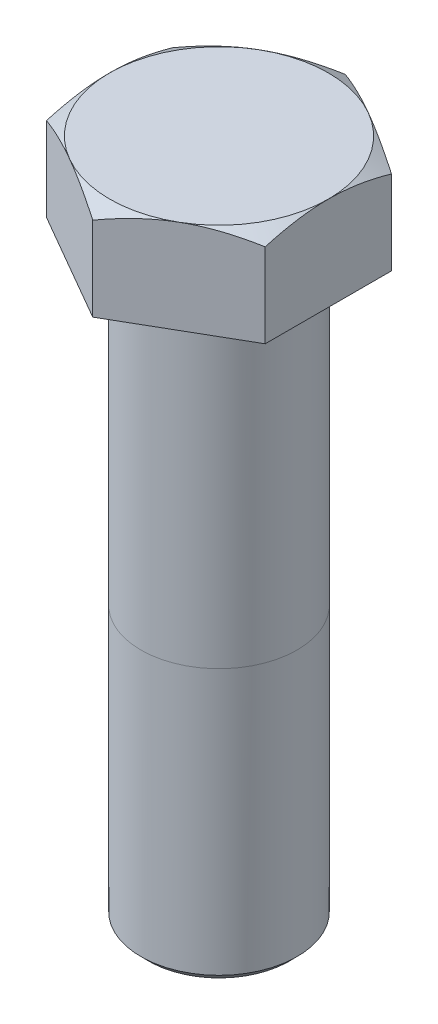
ISO-10303-21;
HEADER;
FILE_DESCRIPTION(('STEP AP214'),'2;1');
FILE_NAME('part.step','',(''),(''),'','','');
FILE_SCHEMA(('AUTOMOTIVE_DESIGN { 1 0 10303 214 1 1 1 1 }'));
ENDSEC;
DATA;
#1=APPLICATION_CONTEXT('core data for automotive mechanical design processes');
#2=APPLICATION_PROTOCOL_DEFINITION('international standard','automotive_design',2000,#1);
#3=PRODUCT_CONTEXT('',#1,'mechanical');
#4=PRODUCT('Part','Part','',(#3));
#5=PRODUCT_RELATED_PRODUCT_CATEGORY('part','',(#4));
#6=PRODUCT_DEFINITION_FORMATION('','',#4);
#7=PRODUCT_DEFINITION_CONTEXT('part definition',#1,'design');
#8=PRODUCT_DEFINITION('design','',#6,#7);
#9=PRODUCT_DEFINITION_SHAPE('','',#8);
#10=(LENGTH_UNIT() NAMED_UNIT(*) SI_UNIT(.MILLI.,.METRE.));
#11=(NAMED_UNIT(*) PLANE_ANGLE_UNIT() SI_UNIT($,.RADIAN.));
#12=(NAMED_UNIT(*) SI_UNIT($,.STERADIAN.) SOLID_ANGLE_UNIT());
#13=UNCERTAINTY_MEASURE_WITH_UNIT(LENGTH_MEASURE(1.E-05),#10,'distance_accuracy_value','');
#14=(GEOMETRIC_REPRESENTATION_CONTEXT(3) GLOBAL_UNCERTAINTY_ASSIGNED_CONTEXT((#13)) GLOBAL_UNIT_ASSIGNED_CONTEXT((#10,
#11,#12)) REPRESENTATION_CONTEXT('',''));
#15=CARTESIAN_POINT('',(0.,0.,0.));
#16=DIRECTION('',(0.,0.,1.));
#17=DIRECTION('',(1.,0.,0.));
#18=AXIS2_PLACEMENT_3D('',#15,#16,#17);
#19=CARTESIAN_POINT('',(0.,-75.,0.));
#20=DIRECTION('',(0.,1.,0.));
#21=DIRECTION('',(0.,0.,1.));
#22=AXIS2_PLACEMENT_3D('',#19,#20,#21);
#23=CYLINDRICAL_SURFACE('',#22,10.);
#24=CARTESIAN_POINT('',(0.,-74.,0.));
#25=DIRECTION('',(0.,-1.,0.));
#26=DIRECTION('',(0.,0.,-1.));
#27=AXIS2_PLACEMENT_3D('',#24,#25,#26);
#28=CIRCLE('',#27,10.);
#29=CARTESIAN_POINT('',(0.,-74.,-10.));
#30=VERTEX_POINT('',#29);
#31=EDGE_CURVE('E233',#30,#30,#28,.F.);
#32=ORIENTED_EDGE('',*,*,#31,.T.);
#33=EDGE_LOOP('',(#32));
#34=FACE_BOUND('',#33,.T.);
#35=CARTESIAN_POINT('',(0.,-40.,0.));
#36=DIRECTION('',(0.,1.,0.));
#37=DIRECTION('',(-1.,0.,0.));
#38=AXIS2_PLACEMENT_3D('',#35,#36,#37);
#39=CIRCLE('',#38,10.);
#40=CARTESIAN_POINT('',(-10.,-40.,0.));
#41=VERTEX_POINT('',#40);
#42=CARTESIAN_POINT('',(10.,-40.,0.));
#43=VERTEX_POINT('',#42);
#44=EDGE_CURVE('E12',#41,#43,#39,.T.);
#45=ORIENTED_EDGE('',*,*,#44,.F.);
#46=EDGE_CURVE('E42',#43,#41,#39,.T.);
#47=ORIENTED_EDGE('',*,*,#46,.F.);
#48=EDGE_LOOP('',(#45,#47));
#49=FACE_BOUND('',#48,.T.);
#50=ADVANCED_FACE('F38',(#34,#49),#23,.T.);
#51=CARTESIAN_POINT('',(0.,0.,0.));
#52=DIRECTION('',(0.,1.,0.));
#53=DIRECTION('',(0.,0.,1.));
#54=AXIS2_PLACEMENT_3D('',#51,#52,#53);
#55=PLANE('',#54);
#56=DIRECTION('',(-0.866025403784438,0.,-0.5));
#57=VECTOR('',#56,1.);
#58=CARTESIAN_POINT('',(14.,0.,-8.08290376865478));
#59=LINE('',#58,#57);
#60=CARTESIAN_POINT('',(14.,0.,-8.08290376865478));
#61=VERTEX_POINT('',#60);
#62=CARTESIAN_POINT('',(0.,0.,-16.1658075373095));
#63=VERTEX_POINT('',#62);
#64=EDGE_CURVE('E122',#61,#63,#59,.T.);
#65=ORIENTED_EDGE('',*,*,#64,.F.);
#66=DIRECTION('',(0.,0.,-1.));
#67=VECTOR('',#66,1.);
#68=CARTESIAN_POINT('',(14.,0.,8.08290376865478));
#69=LINE('',#68,#67);
#70=CARTESIAN_POINT('',(14.,0.,8.08290376865478));
#71=VERTEX_POINT('',#70);
#72=EDGE_CURVE('E396',#71,#61,#69,.T.);
#73=ORIENTED_EDGE('',*,*,#72,.F.);
#74=DIRECTION('',(0.866025403784439,0.,-0.5));
#75=VECTOR('',#74,1.);
#76=CARTESIAN_POINT('',(0.,0.,16.1658075373095));
#77=LINE('',#76,#75);
#78=CARTESIAN_POINT('',(0.,0.,16.1658075373095));
#79=VERTEX_POINT('',#78);
#80=EDGE_CURVE('E391',#79,#71,#77,.T.);
#81=ORIENTED_EDGE('',*,*,#80,.F.);
#82=DIRECTION('',(0.866025403784439,0.,0.5));
#83=VECTOR('',#82,1.);
#84=CARTESIAN_POINT('',(-14.,0.,8.08290376865477));
#85=LINE('',#84,#83);
#86=CARTESIAN_POINT('',(-14.,0.,8.08290376865477));
#87=VERTEX_POINT('',#86);
#88=EDGE_CURVE('E389',#87,#79,#85,.T.);
#89=ORIENTED_EDGE('',*,*,#88,.F.);
#90=DIRECTION('',(0.,0.,1.));
#91=VECTOR('',#90,1.);
#92=CARTESIAN_POINT('',(-14.,0.,-8.08290376865478));
#93=LINE('',#92,#91);
#94=CARTESIAN_POINT('',(-14.,0.,-8.08290376865478));
#95=VERTEX_POINT('',#94);
#96=EDGE_CURVE('E371',#95,#87,#93,.T.);
#97=ORIENTED_EDGE('',*,*,#96,.F.);
#98=DIRECTION('',(-0.866025403784439,0.,0.5));
#99=VECTOR('',#98,1.);
#100=CARTESIAN_POINT('',(0.,0.,-16.1658075373095));
#101=LINE('',#100,#99);
#102=EDGE_CURVE('E386',#63,#95,#101,.T.);
#103=ORIENTED_EDGE('',*,*,#102,.F.);
#104=EDGE_LOOP('',(#65,#73,#81,#89,#97,#103));
#105=FACE_BOUND('',#104,.T.);
#106=CARTESIAN_POINT('',(0.,0.,0.));
#107=DIRECTION('',(0.,1.,0.));
#108=DIRECTION('',(0.,0.,1.));
#109=AXIS2_PLACEMENT_3D('',#106,#107,#108);
#110=CIRCLE('',#109,10.);
#111=CARTESIAN_POINT('',(0.,0.,10.));
#112=VERTEX_POINT('',#111);
#113=EDGE_CURVE('E140',#112,#112,#110,.F.);
#114=ORIENTED_EDGE('',*,*,#113,.F.);
#115=EDGE_LOOP('',(#114));
#116=FACE_BOUND('',#115,.T.);
#117=ADVANCED_FACE('F211',(#105,#116),#55,.F.);
#118=CARTESIAN_POINT('',(14.,12.,-8.08290376865478));
#119=DIRECTION('',(-0.5,0.,0.866025403784439));
#120=DIRECTION('',(0.866025403784439,0.,0.5));
#121=AXIS2_PLACEMENT_3D('',#118,#119,#120);
#122=PLANE('',#121);
#123=CARTESIAN_POINT('',(14.0002,10.7495037679405,-8.08278829860094));
#124=CARTESIAN_POINT('',(13.6924853904181,10.8520687355185,-8.26044741127664));
#125=CARTESIAN_POINT('',(13.3835705284393,10.9499795109551,-8.43879948999678));
#126=CARTESIAN_POINT('',(12.7632636692859,11.1351989694353,-8.79693382210913));
#127=CARTESIAN_POINT('',(12.4518708930622,11.2225041654761,-8.97671652528559));
#128=CARTESIAN_POINT('',(11.8260063991707,11.3853389062415,-9.33805955931009));
#129=CARTESIAN_POINT('',(11.5115292047329,11.4608405894043,-9.51962305217278));
#130=CARTESIAN_POINT('',(10.8803895759989,11.5984470625897,-9.88401168671856));
#131=CARTESIAN_POINT('',(10.5637272674325,11.6605526168897,-10.0668367558116));
#132=CARTESIAN_POINT('',(9.93633151674918,11.7687252680104,-10.429063861357));
#133=CARTESIAN_POINT('',(9.62564465325542,11.8151503964399,-10.6084390056288));
#134=CARTESIAN_POINT('',(9.00284729327513,11.8929951265451,-10.968011229064));
#135=CARTESIAN_POINT('',(8.69073676950317,11.9244144393938,-11.1482083239807));
#136=CARTESIAN_POINT('',(8.06599141476663,11.9714542186344,-11.5089052227128));
#137=CARTESIAN_POINT('',(7.75335765114503,11.9870934589966,-11.6894044102975));
#138=CARTESIAN_POINT('',(7.12780152662096,12.0022367596143,-12.0505694071847));
#139=CARTESIAN_POINT('',(6.81487917493453,12.0017413184259,-12.2312352111663));
#140=CARTESIAN_POINT('',(6.22987230119103,11.9857422399056,-12.5689890871999));
#141=CARTESIAN_POINT('',(5.95774609067864,11.9721901053227,-12.7261012280928));
#142=CARTESIAN_POINT('',(5.41411962233189,11.9331392398875,-13.0399641159314));
#143=CARTESIAN_POINT('',(5.14261941013851,11.9076396640127,-13.1967148365263));
#144=CARTESIAN_POINT('',(4.60039240839667,11.8451385190432,-13.5097697419438));
#145=CARTESIAN_POINT('',(4.32966644468921,11.8081274502385,-13.6660734499669));
#146=CARTESIAN_POINT('',(3.78948373337593,11.7232526731859,-13.9779480837552));
#147=CARTESIAN_POINT('',(3.52002707332628,11.6753882271492,-14.1335189589698));
#148=CARTESIAN_POINT('',(2.70207638818785,11.514304872236,-14.6057630072184));
#149=CARTESIAN_POINT('',(2.15595101855753,11.3850242516312,-14.9210686363857));
#150=CARTESIAN_POINT('',(1.07184369066131,11.0916100987946,-15.546978293977));
#151=CARTESIAN_POINT('',(0.533847852112659,10.9275454762133,-15.857590336186));
#152=CARTESIAN_POINT('',(-0.000199999999997578,10.7495037679405,-16.1659230073634));
#153=B_SPLINE_CURVE_WITH_KNOTS('',3,(#123,#124,#125,#126,#127,#128,#129,#130,#131,#132,#133,
#134,#135,#136,#137,#138,#139,#140,#141,#142,#143,#144,#145,#146,#147,#148,#149,#150,#151,#152),
.UNSPECIFIED.,.F.,.F.,(4,2,2,2,2,2,2,2,2,2,2,2,2,2,4),(0.,1.10950436744395,2.21937254652007,
3.33182219257025,4.44420835421649,5.52913815688045,6.6140888410734,7.69774720328185,
8.78137208085321,9.72469383358151,10.6680823159394,11.6122513923123,12.5564846704803,
14.4864746839191,16.412676387916),.UNSPECIFIED.);
#154=CARTESIAN_POINT('',(14.,10.7495704353214,-8.08290376865478));
#155=VERTEX_POINT('',#154);
#156=CARTESIAN_POINT('',(7.00000000000001,12.,-12.1243556529822));
#157=VERTEX_POINT('',#156);
#158=EDGE_CURVE('E111',#155,#157,#153,.T.);
#159=ORIENTED_EDGE('',*,*,#158,.F.);
#160=DIRECTION('',(0.,-1.,0.));
#161=VECTOR('',#160,1.);
#162=CARTESIAN_POINT('',(14.,12.,-8.08290376865478));
#163=LINE('',#162,#161);
#164=EDGE_CURVE('E399',#155,#61,#163,.T.);
#165=ORIENTED_EDGE('',*,*,#164,.T.);
#166=ORIENTED_EDGE('',*,*,#64,.T.);
#167=DIRECTION('',(0.,-1.,0.));
#168=VECTOR('',#167,1.);
#169=CARTESIAN_POINT('',(0.,12.,-16.1658075373095));
#170=LINE('',#169,#168);
#171=CARTESIAN_POINT('',(0.,10.7495704353214,-16.1658075373095));
#172=VERTEX_POINT('',#171);
#173=EDGE_CURVE('E145',#172,#63,#170,.T.);
#174=ORIENTED_EDGE('',*,*,#173,.F.);
#175=EDGE_CURVE('E123',#157,#172,#153,.T.);
#176=ORIENTED_EDGE('',*,*,#175,.F.);
#177=EDGE_LOOP('',(#159,#165,#166,#174,#176));
#178=FACE_BOUND('',#177,.T.);
#179=ADVANCED_FACE('F143',(#178),#122,.F.);
#180=CARTESIAN_POINT('',(0.,12.,-16.1658075373095));
#181=DIRECTION('',(0.5,0.,0.866025403784439));
#182=DIRECTION('',(0.866025403784439,0.,-0.5));
#183=AXIS2_PLACEMENT_3D('',#180,#181,#182);
#184=PLANE('',#183);
#185=CARTESIAN_POINT('',(0.000200000000001851,10.7495037679405,-16.1659230073634));
#186=CARTESIAN_POINT('',(-0.307514609581919,10.8520687355185,-15.9882638946877));
#187=CARTESIAN_POINT('',(-0.616429471560717,10.9499795109551,-15.8099118159675));
#188=CARTESIAN_POINT('',(-1.23673633071406,11.1351989694353,-15.4517774838552));
#189=CARTESIAN_POINT('',(-1.54812910693776,11.2225041654761,-15.2719947806787));
#190=CARTESIAN_POINT('',(-2.17399360082929,11.3853389062415,-14.9106517466542));
#191=CARTESIAN_POINT('',(-2.48847079526713,11.4608405894043,-14.7290882537915));
#192=CARTESIAN_POINT('',(-3.11961042400107,11.5984470625897,-14.3646996192458));
#193=CARTESIAN_POINT('',(-3.43627273256746,11.6605526168897,-14.1818745501527));
#194=CARTESIAN_POINT('',(-4.06366848325082,11.7687252680104,-13.8196474446073));
#195=CARTESIAN_POINT('',(-4.37435534674458,11.8151503964399,-13.6402723003355));
#196=CARTESIAN_POINT('',(-4.99715270672487,11.8929951265451,-13.2807000769003));
#197=CARTESIAN_POINT('',(-5.30926323049683,11.9244144393938,-13.1005029819836));
#198=CARTESIAN_POINT('',(-5.93400858523337,11.9714542186344,-12.7398060832515));
#199=CARTESIAN_POINT('',(-6.24664234885497,11.9870934589966,-12.5593068956668));
#200=CARTESIAN_POINT('',(-6.87219847337904,12.0022367596143,-12.1981418987796));
#201=CARTESIAN_POINT('',(-7.18512082506547,12.0017413184259,-12.017476094798));
#202=CARTESIAN_POINT('',(-7.77012769880897,11.9857422399056,-11.6797222187644));
#203=CARTESIAN_POINT('',(-8.04225390932136,11.9721901053227,-11.5226100778715));
#204=CARTESIAN_POINT('',(-8.58588037766811,11.9331392398875,-11.2087471900329));
#205=CARTESIAN_POINT('',(-8.85738058986149,11.9076396640127,-11.051996469438));
#206=CARTESIAN_POINT('',(-9.39960759160333,11.8451385190432,-10.7389415640205));
#207=CARTESIAN_POINT('',(-9.67033355531079,11.8081274502385,-10.5826378559974));
#208=CARTESIAN_POINT('',(-10.2105162666241,11.7232526731859,-10.2707632222091));
#209=CARTESIAN_POINT('',(-10.4799729266737,11.6753882271492,-10.1151923469945));
#210=CARTESIAN_POINT('',(-11.2979236118122,11.514304872236,-9.64294829874596));
#211=CARTESIAN_POINT('',(-11.8440489814425,11.3850242516312,-9.32764266957861));
#212=CARTESIAN_POINT('',(-12.9281563093387,11.0916100987946,-8.70173301198729));
#213=CARTESIAN_POINT('',(-13.4661521478873,10.9275454762133,-8.39112096977833));
#214=CARTESIAN_POINT('',(-14.0002,10.7495037679405,-8.08278829860094));
#215=B_SPLINE_CURVE_WITH_KNOTS('',3,(#185,#186,#187,#188,#189,#190,#191,#192,#193,#194,#195,
#196,#197,#198,#199,#200,#201,#202,#203,#204,#205,#206,#207,#208,#209,#210,#211,#212,#213,#214),
.UNSPECIFIED.,.F.,.F.,(4,2,2,2,2,2,2,2,2,2,2,2,2,2,4),(0.,1.10950436744395,2.21937254652007,
3.33182219257025,4.44420835421649,5.52913815688045,6.6140888410734,7.69774720328186,
8.78137208085321,9.72469383358152,10.6680823159394,11.6122513923124,12.5564846704803,
14.4864746839191,16.412676387916),.UNSPECIFIED.);
#216=CARTESIAN_POINT('',(-7.,12.,-12.1243556529822));
#217=VERTEX_POINT('',#216);
#218=EDGE_CURVE('E130',#172,#217,#215,.T.);
#219=ORIENTED_EDGE('',*,*,#218,.F.);
#220=ORIENTED_EDGE('',*,*,#173,.T.);
#221=ORIENTED_EDGE('',*,*,#102,.T.);
#222=DIRECTION('',(0.,-1.,0.));
#223=VECTOR('',#222,1.);
#224=CARTESIAN_POINT('',(-14.,12.,-8.08290376865478));
#225=LINE('',#224,#223);
#226=CARTESIAN_POINT('',(-14.,10.7495704353214,-8.08290376865478));
#227=VERTEX_POINT('',#226);
#228=EDGE_CURVE('E373',#227,#95,#225,.T.);
#229=ORIENTED_EDGE('',*,*,#228,.F.);
#230=EDGE_CURVE('E146',#217,#227,#215,.T.);
#231=ORIENTED_EDGE('',*,*,#230,.F.);
#232=EDGE_LOOP('',(#219,#220,#221,#229,#231));
#233=FACE_BOUND('',#232,.T.);
#234=ADVANCED_FACE('F202',(#233),#184,.F.);
#235=CARTESIAN_POINT('',(-14.,12.,-8.08290376865478));
#236=DIRECTION('',(1.,0.,0.));
#237=DIRECTION('',(0.,0.,-1.));
#238=AXIS2_PLACEMENT_3D('',#235,#236,#237);
#239=PLANE('',#238);
#240=CARTESIAN_POINT('',(-14.,4.99292627411982,-22.0708464349856));
#241=CARTESIAN_POINT('',(-14.,5.14275125073713,-21.763531713594));
#242=CARTESIAN_POINT('',(-14.,5.29185573746869,-21.4558658946682));
#243=CARTESIAN_POINT('',(-14.,5.58846120919052,-20.8397589075048));
#244=CARTESIAN_POINT('',(-14.,5.73596217910167,-20.5313177320094));
#245=CARTESIAN_POINT('',(-14.,6.17585267186016,-19.604644051866));
#246=CARTESIAN_POINT('',(-14.,6.46558794103416,-18.9851469805474));
#247=CARTESIAN_POINT('',(-14.,7.03777843217461,-17.7389229296623));
#248=CARTESIAN_POINT('',(-14.,7.32018844259813,-17.1121751438084));
#249=CARTESIAN_POINT('',(-14.,7.87392351617632,-15.8538185498974));
#250=CARTESIAN_POINT('',(-14.,8.1452490804189,-15.222209963117));
#251=CARTESIAN_POINT('',(-14.,8.68287642466604,-13.9315623858743));
#252=CARTESIAN_POINT('',(-14.,8.94869404876374,-13.2723206995769));
#253=CARTESIAN_POINT('',(-14.,9.46106816037285,-11.9462542996073));
#254=CARTESIAN_POINT('',(-14.,9.70762253788816,-11.279428764378));
#255=CARTESIAN_POINT('',(-14.,10.1752562829552,-9.93829007470016));
#256=CARTESIAN_POINT('',(-14.,10.396384227389,-9.2639939901332));
#257=CARTESIAN_POINT('',(-14.,10.8063230716423,-7.905674386191));
#258=CARTESIAN_POINT('',(-14.,10.9951437751515,-7.22165388619107));
#259=CARTESIAN_POINT('',(-14.,11.2469826274844,-6.1900525924425));
#260=CARTESIAN_POINT('',(-14.,11.3255182689362,-5.84623937601683));
#261=CARTESIAN_POINT('',(-14.,11.4712203231808,-5.15619981120415));
#262=CARTESIAN_POINT('',(-14.,11.5383869516181,-4.80997350871766));
#263=CARTESIAN_POINT('',(-14.,11.6601886053096,-4.1153210756909));
#264=CARTESIAN_POINT('',(-14.,11.7148239340997,-3.76689499864417));
#265=CARTESIAN_POINT('',(-14.,11.8104879102852,-3.06818296151866));
#266=CARTESIAN_POINT('',(-14.,11.8515171744298,-2.71789708647415));
#267=CARTESIAN_POINT('',(-14.,11.9186189966348,-2.02068299874688));
#268=CARTESIAN_POINT('',(-14.,11.9448869150742,-1.6737737051623));
#269=CARTESIAN_POINT('',(-14.,11.9827143530094,-0.979154587539566));
#270=CARTESIAN_POINT('',(-14.,11.9942741270491,-0.631444777459738));
#271=CARTESIAN_POINT('',(-14.,12.0024083352431,0.064155543640295));
#272=CARTESIAN_POINT('',(-14.,11.9989826831407,0.412046055689102));
#273=CARTESIAN_POINT('',(-14.,11.9772334595719,1.10736454649814));
#274=CARTESIAN_POINT('',(-14.,11.9589092283266,1.45479250409178));
#275=CARTESIAN_POINT('',(-14.,11.8981630222529,2.27898980794396));
#276=CARTESIAN_POINT('',(-14.,11.8492724601065,2.75529344550534));
#277=CARTESIAN_POINT('',(-14.,11.7260767898435,3.70457641615978));
#278=CARTESIAN_POINT('',(-14.,11.6517685310033,4.17755532970574));
#279=CARTESIAN_POINT('',(-14.,11.3946404748962,5.59083239459728));
#280=CARTESIAN_POINT('',(-14.,11.1776561389664,6.52500889593939));
#281=CARTESIAN_POINT('',(-14.,10.798626820434,7.92263891857308));
#282=CARTESIAN_POINT('',(-14.,10.6614717947017,8.39326123057302));
#283=CARTESIAN_POINT('',(-14.,10.3722342331958,9.32994176724343));
#284=CARTESIAN_POINT('',(-14.,10.2201515814648,9.79599995642902));
#285=CARTESIAN_POINT('',(-14.,9.9035531763127,10.7236894043673));
#286=CARTESIAN_POINT('',(-14.,9.7390408783588,11.1853218535626));
#287=CARTESIAN_POINT('',(-14.,9.39959441341049,12.1047171749783));
#288=CARTESIAN_POINT('',(-14.,9.22466049104053,12.5624801377385));
#289=CARTESIAN_POINT('',(-14.,8.89155940415482,13.4097205820374));
#290=CARTESIAN_POINT('',(-14.,8.73454468424757,13.7996530958132));
#291=CARTESIAN_POINT('',(-14.,8.41497628488326,14.5772449404882));
#292=CARTESIAN_POINT('',(-14.,8.25242251511155,14.9649042342014));
#293=CARTESIAN_POINT('',(-14.,7.75759096859983,16.1248984757426));
#294=CARTESIAN_POINT('',(-14.,7.4181679417389,16.8941869656031));
#295=CARTESIAN_POINT('',(-14.,6.72486730980364,18.426543943353));
#296=CARTESIAN_POINT('',(-14.,6.3709840654546,19.1896098626505));
#297=CARTESIAN_POINT('',(-14.,5.65222073830814,20.7104937194635));
#298=CARTESIAN_POINT('',(-14.,5.28734111642613,21.4683118753073));
#299=CARTESIAN_POINT('',(-14.,4.54839511560174,22.980981438601));
#300=CARTESIAN_POINT('',(-14.,4.17431468233873,23.7358259632096));
#301=CARTESIAN_POINT('',(-14.,3.41933164006676,25.2420982335973));
#302=CARTESIAN_POINT('',(-14.,3.03842897255752,25.9935259500081));
#303=CARTESIAN_POINT('',(-14.,2.27123454463827,27.4934100989246));
#304=CARTESIAN_POINT('',(-14.,1.88494400638627,28.2418671573457));
#305=CARTESIAN_POINT('',(-14.,1.10790624992865,29.7364586122524));
#306=CARTESIAN_POINT('',(-14.,0.717159046519555,30.4825930164389));
#307=CARTESIAN_POINT('',(-14.,-0.376681710678415,32.558895705312));
#308=CARTESIAN_POINT('',(-14.,-1.08377517374299,33.8869563019829));
#309=CARTESIAN_POINT('',(-14.,-2.5064227733976,36.5386359764745));
#310=CARTESIAN_POINT('',(-14.,-3.22197744331926,37.8622547674929));
#311=CARTESIAN_POINT('',(-14.,-4.65694236685036,40.5015600986259));
#312=CARTESIAN_POINT('',(-14.,-5.37633118483277,41.8172583005949));
#313=CARTESIAN_POINT('',(-14.,-6.45898623229572,43.7887734158136));
#314=CARTESIAN_POINT('',(-14.,-6.82045208995987,44.4455803149352));
#315=CARTESIAN_POINT('',(-14.,-7.544450485575,45.7586049329431));
#316=CARTESIAN_POINT('',(-14.,-7.90698302220205,46.4148226525593));
#317=CARTESIAN_POINT('',(-14.,-8.26998269061019,47.0707819322765));
#318=B_SPLINE_CURVE_WITH_KNOTS('',3,(#240,#241,#242,#243,#244,#245,#246,#247,#248,#249,#250,
#251,#252,#253,#254,#255,#256,#257,#258,#259,#260,#261,#262,#263,#264,#265,#266,#267,#268,#269,
#270,#271,#272,#273,#274,#275,#276,#277,#278,#279,#280,#281,#282,#283,#284,#285,#286,#287,#288,
#289,#290,#291,#292,#293,#294,#295,#296,#297,#298,#299,#300,#301,#302,#303,#304,#305,#306,#307,
#308,#309,#310,#311,#312,#313,#314,#315,#316,#317),.UNSPECIFIED.,.F.,.F.,(4,2,2,2,2,2,2,2,2,2,2,
2,2,2,2,2,2,2,2,2,2,2,2,2,2,2,2,2,2,2,2,2,2,2,2,2,2,2,4),(0.,1.02567303415568,2.0513557051791,
4.10300682741263,6.16523090737516,8.2273616582163,10.3595780473828,12.4920276619918,
14.6203330796551,16.7479915093961,17.8058407791356,18.8636699816202,19.9214735584228,
20.979229179497,22.022634632188,23.066022027118,24.1094154278302,25.1528550374109,
26.5884704486536,28.0242638802512,30.8972352289157,32.3677049505682,33.8381860956821,
35.3082599376037,36.7782992863959,38.0393272664398,39.3003758174946,41.8226756734989,
44.3459687576769,46.8691562242111,49.3964720626359,51.9238095830388,54.4505828486931,
56.977347727673,61.4910052964854,66.0049489056215,70.5035167422899,72.7526215874593,
75.0017236422817),.UNSPECIFIED.);
#319=CARTESIAN_POINT('',(-14.,12.,0.));
#320=VERTEX_POINT('',#319);
#321=EDGE_CURVE('E196',#227,#320,#318,.T.);
#322=ORIENTED_EDGE('',*,*,#321,.F.);
#323=ORIENTED_EDGE('',*,*,#228,.T.);
#324=ORIENTED_EDGE('',*,*,#96,.T.);
#325=DIRECTION('',(0.,-1.,0.));
#326=VECTOR('',#325,1.);
#327=CARTESIAN_POINT('',(-14.,12.,8.08290376865477));
#328=LINE('',#327,#326);
#329=CARTESIAN_POINT('',(-14.,10.7495704353214,8.08290376865477));
#330=VERTEX_POINT('',#329);
#331=EDGE_CURVE('E363',#330,#87,#328,.T.);
#332=ORIENTED_EDGE('',*,*,#331,.F.);
#333=EDGE_CURVE('E191',#320,#330,#318,.T.);
#334=ORIENTED_EDGE('',*,*,#333,.F.);
#335=EDGE_LOOP('',(#322,#323,#324,#332,#334));
#336=FACE_BOUND('',#335,.T.);
#337=ADVANCED_FACE('F198',(#336),#239,.F.);
#338=CARTESIAN_POINT('',(-14.,12.,8.08290376865477));
#339=DIRECTION('',(0.5,0.,-0.866025403784438));
#340=DIRECTION('',(-0.866025403784439,0.,-0.5));
#341=AXIS2_PLACEMENT_3D('',#338,#339,#340);
#342=PLANE('',#341);
#343=CARTESIAN_POINT('',(-14.0002,10.7495037679405,8.08278829860094));
#344=CARTESIAN_POINT('',(-13.6924853904181,10.8520687355185,8.26044741127664));
#345=CARTESIAN_POINT('',(-13.3835705284393,10.9499795109551,8.43879948999678));
#346=CARTESIAN_POINT('',(-12.7632636692859,11.1351989694353,8.79693382210913));
#347=CARTESIAN_POINT('',(-12.4518708930622,11.2225041654761,8.97671652528559));
#348=CARTESIAN_POINT('',(-11.8260063991707,11.3853389062415,9.33805955931009));
#349=CARTESIAN_POINT('',(-11.5115292047329,11.4608405894043,9.51962305217278));
#350=CARTESIAN_POINT('',(-10.8803895759989,11.5984470625897,9.88401168671855));
#351=CARTESIAN_POINT('',(-10.5637272674325,11.6605526168897,10.0668367558116));
#352=CARTESIAN_POINT('',(-9.93633151674919,11.7687252680104,10.429063861357));
#353=CARTESIAN_POINT('',(-9.62564465325543,11.8151503964399,10.6084390056288));
#354=CARTESIAN_POINT('',(-9.00284729327513,11.8929951265451,10.968011229064));
#355=CARTESIAN_POINT('',(-8.69073676950318,11.9244144393938,11.1482083239807));
#356=CARTESIAN_POINT('',(-8.06599141476664,11.9714542186344,11.5089052227128));
#357=CARTESIAN_POINT('',(-7.75335765114504,11.9870934589966,11.6894044102975));
#358=CARTESIAN_POINT('',(-7.12780152662097,12.0022367596143,12.0505694071847));
#359=CARTESIAN_POINT('',(-6.81487917493453,12.0017413184259,12.2312352111663));
#360=CARTESIAN_POINT('',(-6.22987230119103,11.9857422399056,12.5689890871999));
#361=CARTESIAN_POINT('',(-5.95774609067865,11.9721901053227,12.7261012280928));
#362=CARTESIAN_POINT('',(-5.4141196223319,11.9331392398875,13.0399641159314));
#363=CARTESIAN_POINT('',(-5.14261941013852,11.9076396640127,13.1967148365263));
#364=CARTESIAN_POINT('',(-4.60039240839668,11.8451385190432,13.5097697419438));
#365=CARTESIAN_POINT('',(-4.32966644468922,11.8081274502385,13.6660734499669));
#366=CARTESIAN_POINT('',(-3.78948373337593,11.7232526731859,13.9779480837552));
#367=CARTESIAN_POINT('',(-3.52002707332628,11.6753882271492,14.1335189589698));
#368=CARTESIAN_POINT('',(-2.70207638818785,11.514304872236,14.6057630072184));
#369=CARTESIAN_POINT('',(-2.15595101855753,11.3850242516312,14.9210686363857));
#370=CARTESIAN_POINT('',(-1.07184369066132,11.0916100987946,15.546978293977));
#371=CARTESIAN_POINT('',(-0.533847852112665,10.9275454762133,15.857590336186));
#372=CARTESIAN_POINT('',(0.000199999999992472,10.7495037679405,16.1659230073634));
#373=B_SPLINE_CURVE_WITH_KNOTS('',3,(#343,#344,#345,#346,#347,#348,#349,#350,#351,#352,#353,
#354,#355,#356,#357,#358,#359,#360,#361,#362,#363,#364,#365,#366,#367,#368,#369,#370,#371,#372),
.UNSPECIFIED.,.F.,.F.,(4,2,2,2,2,2,2,2,2,2,2,2,2,2,4),(0.,1.10950436744395,2.21937254652007,
3.33182219257025,4.44420835421649,5.52913815688045,6.6140888410734,7.69774720328185,
8.78137208085321,9.72469383358152,10.6680823159394,11.6122513923123,12.5564846704803,
14.4864746839191,16.412676387916),.UNSPECIFIED.);
#374=CARTESIAN_POINT('',(-7.00000000000001,12.,12.1243556529821));
#375=VERTEX_POINT('',#374);
#376=EDGE_CURVE('E197',#330,#375,#373,.T.);
#377=ORIENTED_EDGE('',*,*,#376,.F.);
#378=ORIENTED_EDGE('',*,*,#331,.T.);
#379=ORIENTED_EDGE('',*,*,#88,.T.);
#380=DIRECTION('',(0.,-1.,0.));
#381=VECTOR('',#380,1.);
#382=CARTESIAN_POINT('',(0.,12.,16.1658075373095));
#383=LINE('',#382,#381);
#384=CARTESIAN_POINT('',(0.,10.7495704353214,16.1658075373095));
#385=VERTEX_POINT('',#384);
#386=EDGE_CURVE('E374',#385,#79,#383,.T.);
#387=ORIENTED_EDGE('',*,*,#386,.F.);
#388=EDGE_CURVE('E186',#375,#385,#373,.T.);
#389=ORIENTED_EDGE('',*,*,#388,.F.);
#390=EDGE_LOOP('',(#377,#378,#379,#387,#389));
#391=FACE_BOUND('',#390,.T.);
#392=ADVANCED_FACE('F201',(#391),#342,.F.);
#393=CARTESIAN_POINT('',(0.,12.,16.1658075373095));
#394=DIRECTION('',(-0.5,0.,-0.866025403784439));
#395=DIRECTION('',(-0.866025403784439,0.,0.5));
#396=AXIS2_PLACEMENT_3D('',#393,#394,#395);
#397=PLANE('',#396);
#398=CARTESIAN_POINT('',(-0.000200000000007791,10.7495037679405,16.1659230073634));
#399=CARTESIAN_POINT('',(0.307514609581914,10.8520687355185,15.9882638946877));
#400=CARTESIAN_POINT('',(0.616429471560712,10.9499795109551,15.8099118159675));
#401=CARTESIAN_POINT('',(1.23673633071405,11.1351989694353,15.4517774838552));
#402=CARTESIAN_POINT('',(1.54812910693775,11.2225041654761,15.2719947806787));
#403=CARTESIAN_POINT('',(2.17399360082929,11.3853389062415,14.9106517466542));
#404=CARTESIAN_POINT('',(2.48847079526713,11.4608405894043,14.7290882537915));
#405=CARTESIAN_POINT('',(3.11961042400106,11.5984470625897,14.3646996192458));
#406=CARTESIAN_POINT('',(3.43627273256745,11.6605526168897,14.1818745501527));
#407=CARTESIAN_POINT('',(4.06366848325081,11.7687252680104,13.8196474446073));
#408=CARTESIAN_POINT('',(4.37435534674457,11.8151503964399,13.6402723003355));
#409=CARTESIAN_POINT('',(4.99715270672487,11.8929951265451,13.2807000769003));
#410=CARTESIAN_POINT('',(5.30926323049682,11.9244144393938,13.1005029819836));
#411=CARTESIAN_POINT('',(5.93400858523337,11.9714542186344,12.7398060832515));
#412=CARTESIAN_POINT('',(6.24664234885496,11.9870934589966,12.5593068956668));
#413=CARTESIAN_POINT('',(6.87219847337904,12.0022367596143,12.1981418987796));
#414=CARTESIAN_POINT('',(7.18512082506547,12.0017413184259,12.017476094798));
#415=CARTESIAN_POINT('',(7.77012769880897,11.9857422399056,11.6797222187644));
#416=CARTESIAN_POINT('',(8.04225390932135,11.9721901053227,11.5226100778715));
#417=CARTESIAN_POINT('',(8.58588037766811,11.9331392398875,11.2087471900329));
#418=CARTESIAN_POINT('',(8.85738058986149,11.9076396640127,11.051996469438));
#419=CARTESIAN_POINT('',(9.39960759160332,11.8451385190432,10.7389415640205));
#420=CARTESIAN_POINT('',(9.67033355531078,11.8081274502385,10.5826378559974));
#421=CARTESIAN_POINT('',(10.2105162666241,11.7232526731859,10.2707632222091));
#422=CARTESIAN_POINT('',(10.4799729266737,11.6753882271492,10.1151923469945));
#423=CARTESIAN_POINT('',(11.2979236118121,11.514304872236,9.64294829874596));
#424=CARTESIAN_POINT('',(11.8440489814425,11.3850242516312,9.32764266957861));
#425=CARTESIAN_POINT('',(12.9281563093387,11.0916100987946,8.70173301198729));
#426=CARTESIAN_POINT('',(13.4661521478873,10.9275454762133,8.39112096977833));
#427=CARTESIAN_POINT('',(14.0002,10.7495037679405,8.08278829860094));
#428=B_SPLINE_CURVE_WITH_KNOTS('',3,(#398,#399,#400,#401,#402,#403,#404,#405,#406,#407,#408,
#409,#410,#411,#412,#413,#414,#415,#416,#417,#418,#419,#420,#421,#422,#423,#424,#425,#426,#427),
.UNSPECIFIED.,.F.,.F.,(4,2,2,2,2,2,2,2,2,2,2,2,2,2,4),(0.,1.10950436744395,2.21937254652007,
3.33182219257025,4.44420835421649,5.52913815688045,6.61408884107341,7.69774720328186,
8.78137208085322,9.72469383358152,10.6680823159394,11.6122513923123,12.5564846704803,
14.4864746839191,16.412676387916),.UNSPECIFIED.);
#429=CARTESIAN_POINT('',(7.00000000000001,12.,12.1243556529822));
#430=VERTEX_POINT('',#429);
#431=EDGE_CURVE('E405',#385,#430,#428,.T.);
#432=ORIENTED_EDGE('',*,*,#431,.F.);
#433=ORIENTED_EDGE('',*,*,#386,.T.);
#434=ORIENTED_EDGE('',*,*,#80,.T.);
#435=DIRECTION('',(0.,-1.,0.));
#436=VECTOR('',#435,1.);
#437=CARTESIAN_POINT('',(14.,12.,8.08290376865478));
#438=LINE('',#437,#436);
#439=CARTESIAN_POINT('',(14.,10.7495704353214,8.08290376865478));
#440=VERTEX_POINT('',#439);
#441=EDGE_CURVE('E377',#440,#71,#438,.T.);
#442=ORIENTED_EDGE('',*,*,#441,.F.);
#443=EDGE_CURVE('E180',#430,#440,#428,.T.);
#444=ORIENTED_EDGE('',*,*,#443,.F.);
#445=EDGE_LOOP('',(#432,#433,#434,#442,#444));
#446=FACE_BOUND('',#445,.T.);
#447=ADVANCED_FACE('F324',(#446),#397,.F.);
#448=CARTESIAN_POINT('',(14.,12.,8.08290376865478));
#449=DIRECTION('',(-1.,0.,0.));
#450=DIRECTION('',(0.,0.,1.));
#451=AXIS2_PLACEMENT_3D('',#448,#449,#450);
#452=PLANE('',#451);
#453=CARTESIAN_POINT('',(14.,4.99292626625736,-22.0708464511125));
#454=CARTESIAN_POINT('',(14.,5.14275124303845,-21.7635317294493));
#455=CARTESIAN_POINT('',(14.,5.29185572993371,-21.4558659102519));
#456=CARTESIAN_POINT('',(14.,5.58846120198266,-20.8397589225449));
#457=CARTESIAN_POINT('',(14.,5.73596217205724,-20.5313177467776));
#458=CARTESIAN_POINT('',(14.,6.17585266530547,-19.6046440658177));
#459=CARTESIAN_POINT('',(14.,6.4655879348052,-18.985146993954));
#460=CARTESIAN_POINT('',(14.,7.03777842659724,-17.7389229419706));
#461=CARTESIAN_POINT('',(14.,7.32018843734656,-17.1121751555634));
#462=CARTESIAN_POINT('',(14.,7.87392351157101,-15.8538185605421));
#463=CARTESIAN_POINT('',(14.,8.14524907613404,-15.2222099732047));
#464=CARTESIAN_POINT('',(14.,8.68287642103211,-13.9315623948036));
#465=CARTESIAN_POINT('',(14.,8.94869404545951,-13.2723207079044));
#466=CARTESIAN_POINT('',(14.,9.46106815771064,-11.9462543067215));
#467=CARTESIAN_POINT('',(14.,9.70762253553825,-11.2794287708808));
#468=CARTESIAN_POINT('',(14.,10.1752562812004,-9.93829007996895));
#469=CARTESIAN_POINT('',(14.,10.3963842259171,-9.26399399477939));
#470=CARTESIAN_POINT('',(14.,10.8063230706906,-7.90567438957494));
#471=CARTESIAN_POINT('',(14.,10.9951437744373,-7.22165388893537));
#472=CARTESIAN_POINT('',(14.,11.2469826271114,-6.19005259406052));
#473=CARTESIAN_POINT('',(14.,11.3255182686885,-5.84623937715449));
#474=CARTESIAN_POINT('',(14.,11.4712203231524,-5.15619981137416));
#475=CARTESIAN_POINT('',(14.,11.5383869516838,-4.80997350840038));
#476=CARTESIAN_POINT('',(14.,11.6601886055271,-4.11532107439357));
#477=CARTESIAN_POINT('',(14.,11.714823934375,-3.76689499685408));
#478=CARTESIAN_POINT('',(14.,11.8104879106357,-3.0681829587387));
#479=CARTESIAN_POINT('',(14.,11.8515171747976,-2.71789708319707));
#480=CARTESIAN_POINT('',(14.,11.9186189969932,-2.02068299448594));
#481=CARTESIAN_POINT('',(14.,11.9448869154068,-1.67377370041467));
#482=CARTESIAN_POINT('',(14.,11.982714353247,-0.97915458181931));
#483=CARTESIAN_POINT('',(14.,11.9942741272176,-0.631444771253558));
#484=CARTESIAN_POINT('',(14.,12.0024083352311,0.0641555508148567));
#485=CARTESIAN_POINT('',(14.,11.9989826830173,0.41204606334612));
#486=CARTESIAN_POINT('',(14.,11.9772334591862,1.1073645551138));
#487=CARTESIAN_POINT('',(14.,11.9589092277901,1.45479251318363));
#488=CARTESIAN_POINT('',(14.,11.8981630213455,2.27898981776438));
#489=CARTESIAN_POINT('',(14.,11.8492724589863,2.75529345557609));
#490=CARTESIAN_POINT('',(14.,11.7260767882861,3.70457642671966));
#491=CARTESIAN_POINT('',(14.,11.6517685292217,4.17755534050443));
#492=CARTESIAN_POINT('',(14.,11.3946404724374,5.59083240609909));
#493=CARTESIAN_POINT('',(14.,11.1776561360504,6.52500890789108));
#494=CARTESIAN_POINT('',(14.,10.7986268168437,7.9226389311976));
#495=CARTESIAN_POINT('',(14.,10.661471790885,8.39326124342675));
#496=CARTESIAN_POINT('',(14.,10.3722342289336,9.32994178055291));
#497=CARTESIAN_POINT('',(14.,10.2201515769835,9.79599996996505));
#498=CARTESIAN_POINT('',(14.,9.90355317140099,10.7236894183547));
#499=CARTESIAN_POINT('',(14.,9.73904087323596,11.1853218677748));
#500=CARTESIAN_POINT('',(14.,9.39959440787292,12.1047171896401));
#501=CARTESIAN_POINT('',(14.,9.22466048529936,12.5624801526251));
#502=CARTESIAN_POINT('',(14.,8.89155939813745,13.4097205970991));
#503=CARTESIAN_POINT('',(14.,8.73454467816068,13.7996531108266));
#504=CARTESIAN_POINT('',(14.,8.41497627866838,14.5772449554084));
#505=CARTESIAN_POINT('',(14.,8.25242250883819,14.9649042490767));
#506=CARTESIAN_POINT('',(14.,7.757590962165,16.1248984904875));
#507=CARTESIAN_POINT('',(14.,7.41816793521493,16.894186980267));
#508=CARTESIAN_POINT('',(14.,6.72486730312801,18.4265439578638));
#509=CARTESIAN_POINT('',(14.,6.37098405871645,19.189609877089));
#510=CARTESIAN_POINT('',(14.,5.65222073146375,20.7104937337654));
#511=CARTESIAN_POINT('',(14.,5.287341109538,21.4683118895448));
#512=CARTESIAN_POINT('',(14.,4.54839510864174,22.9809814527115));
#513=CARTESIAN_POINT('',(14.,4.17431467535069,23.7358259772575));
#514=CARTESIAN_POINT('',(14.,3.41933163303289,25.2420982475247));
#515=CARTESIAN_POINT('',(14.,3.03842896550587,25.9935259638776));
#516=CARTESIAN_POINT('',(14.,2.27123453755843,27.4934101126826));
#517=CARTESIAN_POINT('',(14.,1.88494399929602,28.2418671710501));
#518=CARTESIAN_POINT('',(14.,1.10790624282344,29.7364586258524));
#519=CARTESIAN_POINT('',(14.,0.717159039409821,30.4825930299882));
#520=CARTESIAN_POINT('',(14.,-0.376681717839463,32.5588957188084));
#521=CARTESIAN_POINT('',(14.,-1.08377518094661,33.8869563154793));
#522=CARTESIAN_POINT('',(14.,-2.50642278067774,36.5386359899748));
#523=CARTESIAN_POINT('',(14.,-3.22197745063333,37.8622547809972));
#524=CARTESIAN_POINT('',(14.,-4.65694237423436,40.5015601121558));
#525=CARTESIAN_POINT('',(14.,-5.37633119225286,41.8172583141464));
#526=CARTESIAN_POINT('',(14.,-6.45898623976704,43.7887734293992));
#527=CARTESIAN_POINT('',(14.,-6.82045209744784,44.4455803285326));
#528=CARTESIAN_POINT('',(14.,-7.54445049309541,45.7586049465645));
#529=CARTESIAN_POINT('',(14.,-7.90698302973825,46.414822666193));
#530=CARTESIAN_POINT('',(14.,-8.26998269816182,47.0707819459226));
#531=B_SPLINE_CURVE_WITH_KNOTS('',3,(#453,#454,#455,#456,#457,#458,#459,#460,#461,#462,#463,
#464,#465,#466,#467,#468,#469,#470,#471,#472,#473,#474,#475,#476,#477,#478,#479,#480,#481,#482,
#483,#484,#485,#486,#487,#488,#489,#490,#491,#492,#493,#494,#495,#496,#497,#498,#499,#500,#501,
#502,#503,#504,#505,#506,#507,#508,#509,#510,#511,#512,#513,#514,#515,#516,#517,#518,#519,#520,
#521,#522,#523,#524,#525,#526,#527,#528,#529,#530),.UNSPECIFIED.,.F.,.F.,(4,2,2,2,2,2,2,2,2,2,2,
2,2,2,2,2,2,2,2,2,2,2,2,2,2,2,2,2,2,2,2,2,2,2,2,2,2,2,4),(0.,1.02567303510318,2.05135570707411,
4.1030068312029,6.16523091308031,8.22736166583617,10.3595780570469,12.4920276737007,
14.6203330934023,16.7479915251801,17.8058407964076,18.8636700003801,19.921473578669,
20.979229201229,22.0226346553687,23.0660220517475,24.109415453909,25.1528550649388,
26.5884704769934,28.0242639094029,30.8972352596949,32.3677049821978,33.8381861281621,
35.3082599709319,36.7782993205724,38.0393273005601,39.3003758515586,41.8226757074495,
44.3459687915101,46.8691562579273,49.3964720962215,51.9238096164936,54.4505828820193,
56.9773477608708,61.4910053297432,66.0049489389381,70.5035167757153,72.7526216209398,
75.0017236758172),.UNSPECIFIED.);
#532=CARTESIAN_POINT('',(14.,12.,0.));
#533=VERTEX_POINT('',#532);
#534=EDGE_CURVE('E403',#440,#533,#531,.F.);
#535=ORIENTED_EDGE('',*,*,#534,.F.);
#536=ORIENTED_EDGE('',*,*,#441,.T.);
#537=ORIENTED_EDGE('',*,*,#72,.T.);
#538=ORIENTED_EDGE('',*,*,#164,.F.);
#539=EDGE_CURVE('E118',#533,#155,#531,.F.);
#540=ORIENTED_EDGE('',*,*,#539,.F.);
#541=EDGE_LOOP('',(#535,#536,#537,#538,#540));
#542=FACE_BOUND('',#541,.T.);
#543=ADVANCED_FACE('F315',(#542),#452,.F.);
#544=CARTESIAN_POINT('',(0.,12.,0.));
#545=DIRECTION('',(0.,-1.,0.));
#546=DIRECTION('',(0.,0.,1.));
#547=AXIS2_PLACEMENT_3D('',#544,#545,#546);
#548=CONICAL_SURFACE('',#547,14.,1.0471975511966);
#549=ORIENTED_EDGE('',*,*,#388,.T.);
#550=ORIENTED_EDGE('',*,*,#431,.T.);
#551=CARTESIAN_POINT('',(0.,12.,0.));
#552=DIRECTION('',(0.,1.,0.));
#553=DIRECTION('',(0.,0.,1.));
#554=AXIS2_PLACEMENT_3D('',#551,#552,#553);
#555=CIRCLE('',#554,14.);
#556=EDGE_CURVE('E141',#375,#430,#555,.T.);
#557=ORIENTED_EDGE('',*,*,#556,.F.);
#558=EDGE_LOOP('',(#549,#550,#557));
#559=FACE_BOUND('',#558,.T.);
#560=ADVANCED_FACE('F276',(#559),#548,.T.);
#561=ORIENTED_EDGE('',*,*,#333,.T.);
#562=ORIENTED_EDGE('',*,*,#376,.T.);
#563=EDGE_CURVE('E382',#320,#375,#555,.T.);
#564=ORIENTED_EDGE('',*,*,#563,.F.);
#565=EDGE_LOOP('',(#561,#562,#564));
#566=FACE_BOUND('',#565,.T.);
#567=ADVANCED_FACE('F298',(#566),#548,.T.);
#568=ORIENTED_EDGE('',*,*,#230,.T.);
#569=ORIENTED_EDGE('',*,*,#321,.T.);
#570=EDGE_CURVE('E135',#217,#320,#555,.T.);
#571=ORIENTED_EDGE('',*,*,#570,.F.);
#572=EDGE_LOOP('',(#568,#569,#571));
#573=FACE_BOUND('',#572,.T.);
#574=ADVANCED_FACE('F290',(#573),#548,.T.);
#575=ORIENTED_EDGE('',*,*,#175,.T.);
#576=ORIENTED_EDGE('',*,*,#218,.T.);
#577=EDGE_CURVE('E127',#157,#217,#555,.T.);
#578=ORIENTED_EDGE('',*,*,#577,.F.);
#579=EDGE_LOOP('',(#575,#576,#578));
#580=FACE_BOUND('',#579,.T.);
#581=ADVANCED_FACE('F128',(#580),#548,.T.);
#582=ORIENTED_EDGE('',*,*,#158,.T.);
#583=EDGE_CURVE('E115',#533,#157,#555,.T.);
#584=ORIENTED_EDGE('',*,*,#583,.F.);
#585=ORIENTED_EDGE('',*,*,#539,.T.);
#586=EDGE_LOOP('',(#582,#584,#585));
#587=FACE_BOUND('',#586,.T.);
#588=ADVANCED_FACE('F113',(#587),#548,.T.);
#589=ORIENTED_EDGE('',*,*,#443,.T.);
#590=ORIENTED_EDGE('',*,*,#534,.T.);
#591=CARTESIAN_POINT('',(0.,12.,0.));
#592=DIRECTION('',(0.,1.,0.));
#593=DIRECTION('',(0.,0.,1.));
#594=AXIS2_PLACEMENT_3D('',#591,#592,#593);
#595=CIRCLE('',#594,14.);
#596=EDGE_CURVE('E139',#430,#533,#595,.T.);
#597=ORIENTED_EDGE('',*,*,#596,.F.);
#598=EDGE_LOOP('',(#589,#590,#597));
#599=FACE_BOUND('',#598,.T.);
#600=ADVANCED_FACE('F164',(#599),#548,.T.);
#601=CARTESIAN_POINT('',(0.,12.,0.));
#602=DIRECTION('',(0.,1.,0.));
#603=DIRECTION('',(0.,0.,1.));
#604=AXIS2_PLACEMENT_3D('',#601,#602,#603);
#605=PLANE('',#604);
#606=ORIENTED_EDGE('',*,*,#556,.T.);
#607=ORIENTED_EDGE('',*,*,#596,.T.);
#608=ORIENTED_EDGE('',*,*,#583,.T.);
#609=ORIENTED_EDGE('',*,*,#577,.T.);
#610=ORIENTED_EDGE('',*,*,#570,.T.);
#611=ORIENTED_EDGE('',*,*,#563,.T.);
#612=EDGE_LOOP('',(#606,#607,#608,#609,#610,#611));
#613=FACE_BOUND('',#612,.T.);
#614=ADVANCED_FACE('F138',(#613),#605,.T.);
#615=ORIENTED_EDGE('',*,*,#46,.T.);
#616=ORIENTED_EDGE('',*,*,#44,.T.);
#617=EDGE_LOOP('',(#615,#616));
#618=FACE_BOUND('',#617,.T.);
#619=ORIENTED_EDGE('',*,*,#113,.T.);
#620=EDGE_LOOP('',(#619));
#621=FACE_BOUND('',#620,.T.);
#622=ADVANCED_FACE('F165',(#618,#621),#23,.T.);
#623=CARTESIAN_POINT('',(0.,-75.,0.));
#624=DIRECTION('',(0.,-1.,0.));
#625=DIRECTION('',(0.,0.,-1.));
#626=AXIS2_PLACEMENT_3D('',#623,#624,#625);
#627=PLANE('',#626);
#628=CARTESIAN_POINT('',(0.,-75.,0.));
#629=DIRECTION('',(0.,-1.,0.));
#630=DIRECTION('',(0.,0.,-1.));
#631=AXIS2_PLACEMENT_3D('',#628,#629,#630);
#632=CIRCLE('',#631,8.99999999999999);
#633=CARTESIAN_POINT('',(0.,-75.,-8.99999999999999));
#634=VERTEX_POINT('',#633);
#635=EDGE_CURVE('E230',#634,#634,#632,.T.);
#636=ORIENTED_EDGE('',*,*,#635,.T.);
#637=EDGE_LOOP('',(#636));
#638=FACE_BOUND('',#637,.T.);
#639=ADVANCED_FACE('F220',(#638),#627,.T.);
#640=CARTESIAN_POINT('',(0.,-75.,0.));
#641=DIRECTION('',(0.,1.,0.));
#642=DIRECTION('',(0.,0.,1.));
#643=AXIS2_PLACEMENT_3D('',#640,#641,#642);
#644=CONICAL_SURFACE('',#643,8.99999999999999,0.785398163397444);
#645=ORIENTED_EDGE('',*,*,#31,.F.);
#646=EDGE_LOOP('',(#645));
#647=FACE_BOUND('',#646,.T.);
#648=ORIENTED_EDGE('',*,*,#635,.F.);
#649=EDGE_LOOP('',(#648));
#650=FACE_BOUND('',#649,.T.);
#651=ADVANCED_FACE('F40',(#647,#650),#644,.T.);
#652=CLOSED_SHELL('',(#50,#117,#179,#234,#337,#392,#447,#543,#560,#567,#574,#581,#588,#600,#614,
#622,#639,#651));
#653=MANIFOLD_SOLID_BREP('B2',#652);
#654=ADVANCED_BREP_SHAPE_REPRESENTATION('',(#18,#653),#14);
#655=SHAPE_DEFINITION_REPRESENTATION(#9,#654);
ENDSEC;
END-ISO-10303-21;
